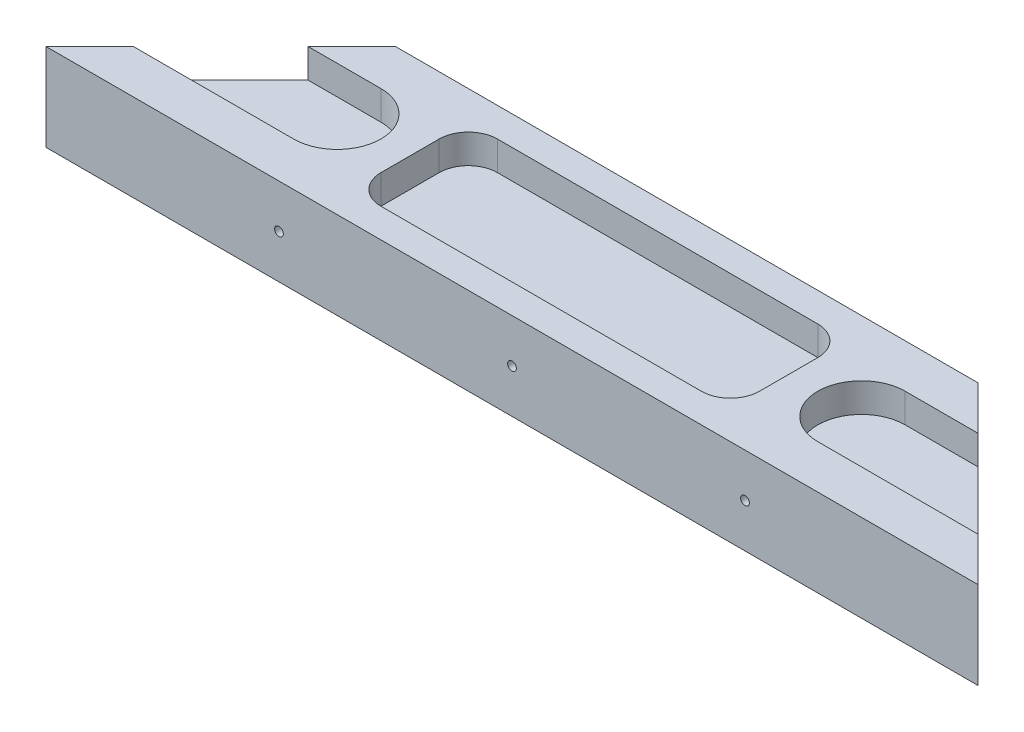
ISO-10303-21;
HEADER;
FILE_DESCRIPTION(('STEP AP214'),'2;1');
FILE_NAME('part.step','',(''),(''),'','','');
FILE_SCHEMA(('AUTOMOTIVE_DESIGN { 1 0 10303 214 1 1 1 1 }'));
ENDSEC;
DATA;
#1=APPLICATION_CONTEXT('core data for automotive mechanical design processes');
#2=APPLICATION_PROTOCOL_DEFINITION('international standard','automotive_design',2000,#1);
#3=PRODUCT_CONTEXT('',#1,'mechanical');
#4=PRODUCT('Part','Part','',(#3));
#5=PRODUCT_RELATED_PRODUCT_CATEGORY('part','',(#4));
#6=PRODUCT_DEFINITION_FORMATION('','',#4);
#7=PRODUCT_DEFINITION_CONTEXT('part definition',#1,'design');
#8=PRODUCT_DEFINITION('design','',#6,#7);
#9=PRODUCT_DEFINITION_SHAPE('','',#8);
#10=(LENGTH_UNIT() NAMED_UNIT(*) SI_UNIT(.MILLI.,.METRE.));
#11=(NAMED_UNIT(*) PLANE_ANGLE_UNIT() SI_UNIT($,.RADIAN.));
#12=(NAMED_UNIT(*) SI_UNIT($,.STERADIAN.) SOLID_ANGLE_UNIT());
#13=UNCERTAINTY_MEASURE_WITH_UNIT(LENGTH_MEASURE(1.E-05),#10,'distance_accuracy_value','');
#14=(GEOMETRIC_REPRESENTATION_CONTEXT(3) GLOBAL_UNCERTAINTY_ASSIGNED_CONTEXT((#13)) GLOBAL_UNIT_ASSIGNED_CONTEXT((#10,
#11,#12)) REPRESENTATION_CONTEXT('',''));
#15=CARTESIAN_POINT('',(0.,0.,0.));
#16=DIRECTION('',(0.,0.,1.));
#17=DIRECTION('',(1.,0.,0.));
#18=AXIS2_PLACEMENT_3D('',#15,#16,#17);
#19=CARTESIAN_POINT('',(30.,15.,-30.));
#20=DIRECTION('',(0.707106781186547,0.,0.707106781186548));
#21=DIRECTION('',(0.707106781186548,0.,-0.707106781186547));
#22=AXIS2_PLACEMENT_3D('',#19,#20,#21);
#23=PLANE('',#22);
#24=DIRECTION('',(-0.707106781186548,0.,0.707106781186547));
#25=VECTOR('',#24,1.);
#26=CARTESIAN_POINT('',(30.,10.,-30.));
#27=LINE('',#26,#25);
#28=CARTESIAN_POINT('',(22.5,10.,-22.5));
#29=VERTEX_POINT('',#28);
#30=CARTESIAN_POINT('',(7.5,10.,-7.5));
#31=VERTEX_POINT('',#30);
#32=EDGE_CURVE('E11',#29,#31,#27,.T.);
#33=ORIENTED_EDGE('',*,*,#32,.F.);
#34=DIRECTION('',(0.,1.,0.));
#35=VECTOR('',#34,1.);
#36=CARTESIAN_POINT('',(22.5,15.,-22.5));
#37=LINE('',#36,#35);
#38=CARTESIAN_POINT('',(22.5,15.,-22.5));
#39=VERTEX_POINT('',#38);
#40=EDGE_CURVE('E306',#29,#39,#37,.T.);
#41=ORIENTED_EDGE('',*,*,#40,.T.);
#42=DIRECTION('',(-0.707106781186548,0.,0.707106781186547));
#43=VECTOR('',#42,1.);
#44=CARTESIAN_POINT('',(30.,15.,-30.));
#45=LINE('',#44,#43);
#46=CARTESIAN_POINT('',(30.,15.,-30.));
#47=VERTEX_POINT('',#46);
#48=EDGE_CURVE('E310',#47,#39,#45,.T.);
#49=ORIENTED_EDGE('',*,*,#48,.F.);
#50=DIRECTION('',(0.,-1.,0.));
#51=VECTOR('',#50,1.);
#52=CARTESIAN_POINT('',(30.,15.,-30.));
#53=LINE('',#52,#51);
#54=CARTESIAN_POINT('',(30.,0.,-30.));
#55=VERTEX_POINT('',#54);
#56=EDGE_CURVE('E322',#47,#55,#53,.T.);
#57=ORIENTED_EDGE('',*,*,#56,.T.);
#58=DIRECTION('',(-0.707106781186548,0.,0.707106781186547));
#59=VECTOR('',#58,1.);
#60=CARTESIAN_POINT('',(30.,0.,-30.));
#61=LINE('',#60,#59);
#62=CARTESIAN_POINT('',(0.,0.,0.));
#63=VERTEX_POINT('',#62);
#64=EDGE_CURVE('E309',#55,#63,#61,.T.);
#65=ORIENTED_EDGE('',*,*,#64,.T.);
#66=DIRECTION('',(0.,-1.,0.));
#67=VECTOR('',#66,1.);
#68=CARTESIAN_POINT('',(0.,15.,0.));
#69=LINE('',#68,#67);
#70=CARTESIAN_POINT('',(0.,15.,0.));
#71=VERTEX_POINT('',#70);
#72=EDGE_CURVE('E339',#71,#63,#69,.T.);
#73=ORIENTED_EDGE('',*,*,#72,.F.);
#74=CARTESIAN_POINT('',(7.5,15.,-7.5));
#75=VERTEX_POINT('',#74);
#76=EDGE_CURVE('E314',#75,#71,#45,.T.);
#77=ORIENTED_EDGE('',*,*,#76,.F.);
#78=DIRECTION('',(0.,-1.,0.));
#79=VECTOR('',#78,1.);
#80=CARTESIAN_POINT('',(7.5,15.,-7.5));
#81=LINE('',#80,#79);
#82=EDGE_CURVE('E303',#75,#31,#81,.T.);
#83=ORIENTED_EDGE('',*,*,#82,.T.);
#84=EDGE_LOOP('',(#33,#41,#49,#57,#65,#73,#77,#83));
#85=FACE_BOUND('',#84,.T.);
#86=ADVANCED_FACE('F39',(#85),#23,.F.);
#87=CARTESIAN_POINT('',(0.,15.,0.));
#88=DIRECTION('',(0.,0.,-1.));
#89=DIRECTION('',(-1.,0.,0.));
#90=AXIS2_PLACEMENT_3D('',#87,#88,#89);
#91=PLANE('',#90);
#92=CARTESIAN_POINT('',(120.,7.5,0.));
#93=DIRECTION('',(0.,0.,1.));
#94=DIRECTION('',(1.,0.,0.));
#95=AXIS2_PLACEMENT_3D('',#92,#93,#94);
#96=CIRCLE('',#95,0.749999999999999);
#97=CARTESIAN_POINT('',(120.75,7.5,0.));
#98=VERTEX_POINT('',#97);
#99=EDGE_CURVE('E250',#98,#98,#96,.T.);
#100=ORIENTED_EDGE('',*,*,#99,.F.);
#101=EDGE_LOOP('',(#100));
#102=FACE_BOUND('',#101,.T.);
#103=CARTESIAN_POINT('',(40.,7.5,0.));
#104=DIRECTION('',(0.,0.,1.));
#105=DIRECTION('',(1.,0.,0.));
#106=AXIS2_PLACEMENT_3D('',#103,#104,#105);
#107=CIRCLE('',#106,0.749999999999999);
#108=CARTESIAN_POINT('',(40.75,7.5,0.));
#109=VERTEX_POINT('',#108);
#110=EDGE_CURVE('E249',#109,#109,#107,.T.);
#111=ORIENTED_EDGE('',*,*,#110,.F.);
#112=EDGE_LOOP('',(#111));
#113=FACE_BOUND('',#112,.T.);
#114=CARTESIAN_POINT('',(80.,7.5,0.));
#115=DIRECTION('',(0.,0.,1.));
#116=DIRECTION('',(1.,0.,0.));
#117=AXIS2_PLACEMENT_3D('',#114,#115,#116);
#118=CIRCLE('',#117,0.749999999999999);
#119=CARTESIAN_POINT('',(80.75,7.5,0.));
#120=VERTEX_POINT('',#119);
#121=EDGE_CURVE('E253',#120,#120,#118,.T.);
#122=ORIENTED_EDGE('',*,*,#121,.F.);
#123=EDGE_LOOP('',(#122));
#124=FACE_BOUND('',#123,.T.);
#125=DIRECTION('',(1.,0.,0.));
#126=VECTOR('',#125,1.);
#127=CARTESIAN_POINT('',(0.,0.,0.));
#128=LINE('',#127,#126);
#129=CARTESIAN_POINT('',(160.,0.,0.));
#130=VERTEX_POINT('',#129);
#131=EDGE_CURVE('E325',#63,#130,#128,.T.);
#132=ORIENTED_EDGE('',*,*,#131,.T.);
#133=DIRECTION('',(0.,-1.,0.));
#134=VECTOR('',#133,1.);
#135=CARTESIAN_POINT('',(160.,15.,0.));
#136=LINE('',#135,#134);
#137=CARTESIAN_POINT('',(160.,15.,0.));
#138=VERTEX_POINT('',#137);
#139=EDGE_CURVE('E336',#138,#130,#136,.T.);
#140=ORIENTED_EDGE('',*,*,#139,.F.);
#141=DIRECTION('',(1.,0.,0.));
#142=VECTOR('',#141,1.);
#143=CARTESIAN_POINT('',(0.,15.,0.));
#144=LINE('',#143,#142);
#145=EDGE_CURVE('E313',#71,#138,#144,.T.);
#146=ORIENTED_EDGE('',*,*,#145,.F.);
#147=ORIENTED_EDGE('',*,*,#72,.T.);
#148=EDGE_LOOP('',(#132,#140,#146,#147));
#149=FACE_BOUND('',#148,.T.);
#150=ADVANCED_FACE('F395',(#102,#113,#124,#149),#91,.F.);
#151=CARTESIAN_POINT('',(160.,15.,0.));
#152=DIRECTION('',(-0.707106781186547,0.,0.707106781186548));
#153=DIRECTION('',(0.707106781186548,0.,0.707106781186547));
#154=AXIS2_PLACEMENT_3D('',#151,#152,#153);
#155=PLANE('',#154);
#156=DIRECTION('',(0.707106781186548,0.,0.707106781186547));
#157=VECTOR('',#156,1.);
#158=CARTESIAN_POINT('',(160.,10.,0.));
#159=LINE('',#158,#157);
#160=CARTESIAN_POINT('',(137.5,10.,-22.5));
#161=VERTEX_POINT('',#160);
#162=CARTESIAN_POINT('',(152.5,10.,-7.50000000000001));
#163=VERTEX_POINT('',#162);
#164=EDGE_CURVE('E46',#161,#163,#159,.T.);
#165=ORIENTED_EDGE('',*,*,#164,.T.);
#166=DIRECTION('',(0.,1.,0.));
#167=VECTOR('',#166,1.);
#168=CARTESIAN_POINT('',(152.5,15.,-7.50000000000001));
#169=LINE('',#168,#167);
#170=CARTESIAN_POINT('',(152.5,15.,-7.50000000000001));
#171=VERTEX_POINT('',#170);
#172=EDGE_CURVE('E300',#163,#171,#169,.T.);
#173=ORIENTED_EDGE('',*,*,#172,.T.);
#174=DIRECTION('',(-0.707106781186548,0.,-0.707106781186547));
#175=VECTOR('',#174,1.);
#176=CARTESIAN_POINT('',(160.,15.,0.));
#177=LINE('',#176,#175);
#178=EDGE_CURVE('E317',#138,#171,#177,.T.);
#179=ORIENTED_EDGE('',*,*,#178,.F.);
#180=ORIENTED_EDGE('',*,*,#139,.T.);
#181=DIRECTION('',(-0.707106781186548,0.,-0.707106781186547));
#182=VECTOR('',#181,1.);
#183=CARTESIAN_POINT('',(160.,0.,0.));
#184=LINE('',#183,#182);
#185=CARTESIAN_POINT('',(130.,0.,-30.));
#186=VERTEX_POINT('',#185);
#187=EDGE_CURVE('E327',#130,#186,#184,.T.);
#188=ORIENTED_EDGE('',*,*,#187,.T.);
#189=DIRECTION('',(0.,-1.,0.));
#190=VECTOR('',#189,1.);
#191=CARTESIAN_POINT('',(130.,15.,-30.));
#192=LINE('',#191,#190);
#193=CARTESIAN_POINT('',(130.,15.,-30.));
#194=VERTEX_POINT('',#193);
#195=EDGE_CURVE('E333',#194,#186,#192,.T.);
#196=ORIENTED_EDGE('',*,*,#195,.F.);
#197=CARTESIAN_POINT('',(137.5,15.,-22.5));
#198=VERTEX_POINT('',#197);
#199=EDGE_CURVE('E316',#198,#194,#177,.T.);
#200=ORIENTED_EDGE('',*,*,#199,.F.);
#201=DIRECTION('',(0.,-1.,0.));
#202=VECTOR('',#201,1.);
#203=CARTESIAN_POINT('',(137.5,15.,-22.5));
#204=LINE('',#203,#202);
#205=EDGE_CURVE('E61',#198,#161,#204,.T.);
#206=ORIENTED_EDGE('',*,*,#205,.T.);
#207=EDGE_LOOP('',(#165,#173,#179,#180,#188,#196,#200,#206));
#208=FACE_BOUND('',#207,.T.);
#209=ADVANCED_FACE('F348',(#208),#155,.F.);
#210=CARTESIAN_POINT('',(130.,15.,-30.));
#211=DIRECTION('',(0.,0.,1.));
#212=DIRECTION('',(1.,0.,0.));
#213=AXIS2_PLACEMENT_3D('',#210,#211,#212);
#214=PLANE('',#213);
#215=CARTESIAN_POINT('',(120.,7.5,-30.));
#216=DIRECTION('',(0.,0.,1.));
#217=DIRECTION('',(1.,0.,0.));
#218=AXIS2_PLACEMENT_3D('',#215,#216,#217);
#219=CIRCLE('',#218,0.749999999999999);
#220=CARTESIAN_POINT('',(120.75,7.5,-30.));
#221=VERTEX_POINT('',#220);
#222=EDGE_CURVE('E234',#221,#221,#219,.F.);
#223=ORIENTED_EDGE('',*,*,#222,.F.);
#224=EDGE_LOOP('',(#223));
#225=FACE_BOUND('',#224,.T.);
#226=CARTESIAN_POINT('',(40.,7.5,-30.));
#227=DIRECTION('',(0.,0.,1.));
#228=DIRECTION('',(1.,0.,0.));
#229=AXIS2_PLACEMENT_3D('',#226,#227,#228);
#230=CIRCLE('',#229,0.749999999999999);
#231=CARTESIAN_POINT('',(40.75,7.5,-30.));
#232=VERTEX_POINT('',#231);
#233=EDGE_CURVE('E246',#232,#232,#230,.F.);
#234=ORIENTED_EDGE('',*,*,#233,.F.);
#235=EDGE_LOOP('',(#234));
#236=FACE_BOUND('',#235,.T.);
#237=CARTESIAN_POINT('',(80.,7.5,-30.));
#238=DIRECTION('',(0.,0.,1.));
#239=DIRECTION('',(1.,0.,0.));
#240=AXIS2_PLACEMENT_3D('',#237,#238,#239);
#241=CIRCLE('',#240,0.749999999999999);
#242=CARTESIAN_POINT('',(80.75,7.5,-30.));
#243=VERTEX_POINT('',#242);
#244=EDGE_CURVE('E260',#243,#243,#241,.F.);
#245=ORIENTED_EDGE('',*,*,#244,.F.);
#246=EDGE_LOOP('',(#245));
#247=FACE_BOUND('',#246,.T.);
#248=DIRECTION('',(-1.,0.,0.));
#249=VECTOR('',#248,1.);
#250=CARTESIAN_POINT('',(130.,0.,-30.));
#251=LINE('',#250,#249);
#252=EDGE_CURVE('E329',#186,#55,#251,.T.);
#253=ORIENTED_EDGE('',*,*,#252,.T.);
#254=ORIENTED_EDGE('',*,*,#56,.F.);
#255=DIRECTION('',(-1.,0.,0.));
#256=VECTOR('',#255,1.);
#257=CARTESIAN_POINT('',(130.,15.,-30.));
#258=LINE('',#257,#256);
#259=EDGE_CURVE('E320',#194,#47,#258,.T.);
#260=ORIENTED_EDGE('',*,*,#259,.F.);
#261=ORIENTED_EDGE('',*,*,#195,.T.);
#262=EDGE_LOOP('',(#253,#254,#260,#261));
#263=FACE_BOUND('',#262,.T.);
#264=ADVANCED_FACE('F376',(#225,#236,#247,#263),#214,.F.);
#265=CARTESIAN_POINT('',(0.,15.,0.));
#266=DIRECTION('',(0.,-1.,0.));
#267=DIRECTION('',(0.,0.,-1.));
#268=AXIS2_PLACEMENT_3D('',#265,#266,#267);
#269=PLANE('',#268);
#270=DIRECTION('',(-1.,0.,0.));
#271=VECTOR('',#270,1.);
#272=CARTESIAN_POINT('',(52.5,15.,-25.));
#273=LINE('',#272,#271);
#274=CARTESIAN_POINT('',(107.5,15.,-25.));
#275=VERTEX_POINT('',#274);
#276=CARTESIAN_POINT('',(52.5,15.,-25.));
#277=VERTEX_POINT('',#276);
#278=EDGE_CURVE('E216',#275,#277,#273,.T.);
#279=ORIENTED_EDGE('',*,*,#278,.F.);
#280=CARTESIAN_POINT('',(107.5,15.,-20.));
#281=DIRECTION('',(0.,1.,0.));
#282=DIRECTION('',(0.,0.,-1.));
#283=AXIS2_PLACEMENT_3D('',#280,#281,#282);
#284=CIRCLE('',#283,5.);
#285=CARTESIAN_POINT('',(112.5,15.,-20.));
#286=VERTEX_POINT('',#285);
#287=EDGE_CURVE('E53',#286,#275,#284,.T.);
#288=ORIENTED_EDGE('',*,*,#287,.F.);
#289=DIRECTION('',(0.,0.,-1.));
#290=VECTOR('',#289,1.);
#291=CARTESIAN_POINT('',(112.5,15.,-20.));
#292=LINE('',#291,#290);
#293=CARTESIAN_POINT('',(112.5,15.,-10.));
#294=VERTEX_POINT('',#293);
#295=EDGE_CURVE('E196',#294,#286,#292,.T.);
#296=ORIENTED_EDGE('',*,*,#295,.F.);
#297=CARTESIAN_POINT('',(107.5,15.,-10.));
#298=DIRECTION('',(0.,1.,0.));
#299=DIRECTION('',(0.,0.,1.));
#300=AXIS2_PLACEMENT_3D('',#297,#298,#299);
#301=CIRCLE('',#300,5.);
#302=CARTESIAN_POINT('',(107.5,15.,-5.));
#303=VERTEX_POINT('',#302);
#304=EDGE_CURVE('E199',#303,#294,#301,.T.);
#305=ORIENTED_EDGE('',*,*,#304,.F.);
#306=DIRECTION('',(1.,0.,0.));
#307=VECTOR('',#306,1.);
#308=CARTESIAN_POINT('',(52.5,15.,-5.));
#309=LINE('',#308,#307);
#310=CARTESIAN_POINT('',(52.5,15.,-5.));
#311=VERTEX_POINT('',#310);
#312=EDGE_CURVE('E227',#311,#303,#309,.T.);
#313=ORIENTED_EDGE('',*,*,#312,.F.);
#314=CARTESIAN_POINT('',(52.5,15.,-10.));
#315=DIRECTION('',(0.,1.,0.));
#316=DIRECTION('',(0.,0.,1.));
#317=AXIS2_PLACEMENT_3D('',#314,#315,#316);
#318=CIRCLE('',#317,5.);
#319=CARTESIAN_POINT('',(47.5,15.,-10.));
#320=VERTEX_POINT('',#319);
#321=EDGE_CURVE('E224',#320,#311,#318,.T.);
#322=ORIENTED_EDGE('',*,*,#321,.F.);
#323=DIRECTION('',(0.,0.,1.));
#324=VECTOR('',#323,1.);
#325=CARTESIAN_POINT('',(47.5,15.,-20.));
#326=LINE('',#325,#324);
#327=CARTESIAN_POINT('',(47.5,15.,-20.));
#328=VERTEX_POINT('',#327);
#329=EDGE_CURVE('E221',#328,#320,#326,.T.);
#330=ORIENTED_EDGE('',*,*,#329,.F.);
#331=CARTESIAN_POINT('',(52.5,15.,-20.));
#332=DIRECTION('',(0.,1.,0.));
#333=DIRECTION('',(0.,0.,1.));
#334=AXIS2_PLACEMENT_3D('',#331,#332,#333);
#335=CIRCLE('',#334,5.);
#336=EDGE_CURVE('E218',#277,#328,#335,.T.);
#337=ORIENTED_EDGE('',*,*,#336,.F.);
#338=EDGE_LOOP('',(#279,#288,#296,#305,#313,#322,#330,#337));
#339=FACE_BOUND('',#338,.T.);
#340=ORIENTED_EDGE('',*,*,#48,.T.);
#341=DIRECTION('',(-1.,0.,0.));
#342=VECTOR('',#341,1.);
#343=CARTESIAN_POINT('',(-5.,15.,-22.5));
#344=LINE('',#343,#342);
#345=CARTESIAN_POINT('',(35.,15.,-22.5));
#346=VERTEX_POINT('',#345);
#347=EDGE_CURVE('E267',#346,#39,#344,.T.);
#348=ORIENTED_EDGE('',*,*,#347,.F.);
#349=CARTESIAN_POINT('',(35.,15.,-15.));
#350=DIRECTION('',(0.,1.,0.));
#351=DIRECTION('',(0.,0.,1.));
#352=AXIS2_PLACEMENT_3D('',#349,#350,#351);
#353=CIRCLE('',#352,7.5);
#354=CARTESIAN_POINT('',(35.,15.,-7.5));
#355=VERTEX_POINT('',#354);
#356=EDGE_CURVE('E274',#355,#346,#353,.T.);
#357=ORIENTED_EDGE('',*,*,#356,.F.);
#358=DIRECTION('',(-1.,0.,0.));
#359=VECTOR('',#358,1.);
#360=CARTESIAN_POINT('',(0.,15.,-7.5));
#361=LINE('',#360,#359);
#362=EDGE_CURVE('E344',#355,#75,#361,.T.);
#363=ORIENTED_EDGE('',*,*,#362,.T.);
#364=ORIENTED_EDGE('',*,*,#76,.T.);
#365=ORIENTED_EDGE('',*,*,#145,.T.);
#366=ORIENTED_EDGE('',*,*,#178,.T.);
#367=DIRECTION('',(1.,0.,0.));
#368=VECTOR('',#367,1.);
#369=CARTESIAN_POINT('',(165.,15.,-7.50000000000001));
#370=LINE('',#369,#368);
#371=CARTESIAN_POINT('',(125.,15.,-7.50000000000002));
#372=VERTEX_POINT('',#371);
#373=EDGE_CURVE('E288',#372,#171,#370,.T.);
#374=ORIENTED_EDGE('',*,*,#373,.F.);
#375=CARTESIAN_POINT('',(125.,15.,-15.));
#376=DIRECTION('',(0.,1.,0.));
#377=DIRECTION('',(0.,0.,-1.));
#378=AXIS2_PLACEMENT_3D('',#375,#376,#377);
#379=CIRCLE('',#378,7.49999999999999);
#380=CARTESIAN_POINT('',(125.,15.,-22.5));
#381=VERTEX_POINT('',#380);
#382=EDGE_CURVE('E277',#381,#372,#379,.T.);
#383=ORIENTED_EDGE('',*,*,#382,.F.);
#384=DIRECTION('',(1.,0.,0.));
#385=VECTOR('',#384,1.);
#386=CARTESIAN_POINT('',(0.,15.,-22.5));
#387=LINE('',#386,#385);
#388=EDGE_CURVE('E342',#381,#198,#387,.T.);
#389=ORIENTED_EDGE('',*,*,#388,.T.);
#390=ORIENTED_EDGE('',*,*,#199,.T.);
#391=ORIENTED_EDGE('',*,*,#259,.T.);
#392=EDGE_LOOP('',(#340,#348,#357,#363,#364,#365,#366,#374,#383,#389,#390,#391));
#393=FACE_BOUND('',#392,.T.);
#394=ADVANCED_FACE('F364',(#339,#393),#269,.F.);
#395=CARTESIAN_POINT('',(0.,0.,0.));
#396=DIRECTION('',(0.,-1.,0.));
#397=DIRECTION('',(0.,0.,-1.));
#398=AXIS2_PLACEMENT_3D('',#395,#396,#397);
#399=PLANE('',#398);
#400=ORIENTED_EDGE('',*,*,#64,.F.);
#401=ORIENTED_EDGE('',*,*,#252,.F.);
#402=ORIENTED_EDGE('',*,*,#187,.F.);
#403=ORIENTED_EDGE('',*,*,#131,.F.);
#404=EDGE_LOOP('',(#400,#401,#402,#403));
#405=FACE_BOUND('',#404,.T.);
#406=ADVANCED_FACE('F373',(#405),#399,.T.);
#407=CARTESIAN_POINT('',(165.,10.,-15.));
#408=DIRECTION('',(0.,-1.,0.));
#409=DIRECTION('',(0.,0.,-1.));
#410=AXIS2_PLACEMENT_3D('',#407,#408,#409);
#411=PLANE('',#410);
#412=DIRECTION('',(-1.,0.,0.));
#413=VECTOR('',#412,1.);
#414=CARTESIAN_POINT('',(165.,10.,-22.5));
#415=LINE('',#414,#413);
#416=CARTESIAN_POINT('',(125.,10.,-22.5));
#417=VERTEX_POINT('',#416);
#418=EDGE_CURVE('E290',#161,#417,#415,.T.);
#419=ORIENTED_EDGE('',*,*,#418,.T.);
#420=CARTESIAN_POINT('',(125.,10.,-15.));
#421=DIRECTION('',(0.,1.,0.));
#422=DIRECTION('',(0.,0.,-1.));
#423=AXIS2_PLACEMENT_3D('',#420,#421,#422);
#424=CIRCLE('',#423,7.49999999999999);
#425=CARTESIAN_POINT('',(125.,10.,-7.50000000000002));
#426=VERTEX_POINT('',#425);
#427=EDGE_CURVE('E295',#417,#426,#424,.T.);
#428=ORIENTED_EDGE('',*,*,#427,.T.);
#429=DIRECTION('',(1.,0.,0.));
#430=VECTOR('',#429,1.);
#431=CARTESIAN_POINT('',(165.,10.,-7.50000000000001));
#432=LINE('',#431,#430);
#433=EDGE_CURVE('E286',#426,#163,#432,.T.);
#434=ORIENTED_EDGE('',*,*,#433,.T.);
#435=ORIENTED_EDGE('',*,*,#164,.F.);
#436=EDGE_LOOP('',(#419,#428,#434,#435));
#437=FACE_BOUND('',#436,.T.);
#438=ADVANCED_FACE('F352',(#437),#411,.F.);
#439=CARTESIAN_POINT('',(165.,10.,-7.50000000000001));
#440=DIRECTION('',(0.,0.,1.));
#441=DIRECTION('',(1.,0.,0.));
#442=AXIS2_PLACEMENT_3D('',#439,#440,#441);
#443=PLANE('',#442);
#444=ORIENTED_EDGE('',*,*,#433,.F.);
#445=DIRECTION('',(0.,1.,0.));
#446=VECTOR('',#445,1.);
#447=CARTESIAN_POINT('',(125.,10.,-7.50000000000002));
#448=LINE('',#447,#446);
#449=EDGE_CURVE('E263',#426,#372,#448,.T.);
#450=ORIENTED_EDGE('',*,*,#449,.T.);
#451=ORIENTED_EDGE('',*,*,#373,.T.);
#452=ORIENTED_EDGE('',*,*,#172,.F.);
#453=EDGE_LOOP('',(#444,#450,#451,#452));
#454=FACE_BOUND('',#453,.T.);
#455=ADVANCED_FACE('F361',(#454),#443,.F.);
#456=CARTESIAN_POINT('',(165.,10.,-22.5));
#457=DIRECTION('',(0.,0.,-1.));
#458=DIRECTION('',(-1.,0.,0.));
#459=AXIS2_PLACEMENT_3D('',#456,#457,#458);
#460=PLANE('',#459);
#461=ORIENTED_EDGE('',*,*,#388,.F.);
#462=DIRECTION('',(0.,1.,0.));
#463=VECTOR('',#462,1.);
#464=CARTESIAN_POINT('',(125.,10.,-22.5));
#465=LINE('',#464,#463);
#466=EDGE_CURVE('E283',#417,#381,#465,.T.);
#467=ORIENTED_EDGE('',*,*,#466,.F.);
#468=ORIENTED_EDGE('',*,*,#418,.F.);
#469=ORIENTED_EDGE('',*,*,#205,.F.);
#470=EDGE_LOOP('',(#461,#467,#468,#469));
#471=FACE_BOUND('',#470,.T.);
#472=ADVANCED_FACE('F355',(#471),#460,.F.);
#473=CARTESIAN_POINT('',(125.,10.,-15.));
#474=DIRECTION('',(0.,1.,0.));
#475=DIRECTION('',(0.,0.,1.));
#476=AXIS2_PLACEMENT_3D('',#473,#474,#475);
#477=CYLINDRICAL_SURFACE('',#476,7.49999999999999);
#478=ORIENTED_EDGE('',*,*,#382,.T.);
#479=ORIENTED_EDGE('',*,*,#449,.F.);
#480=ORIENTED_EDGE('',*,*,#427,.F.);
#481=ORIENTED_EDGE('',*,*,#466,.T.);
#482=EDGE_LOOP('',(#478,#479,#480,#481));
#483=FACE_BOUND('',#482,.T.);
#484=ADVANCED_FACE('F359',(#483),#477,.F.);
#485=CARTESIAN_POINT('',(-5.,10.,-15.));
#486=DIRECTION('',(0.,1.,0.));
#487=DIRECTION('',(0.,0.,1.));
#488=AXIS2_PLACEMENT_3D('',#485,#486,#487);
#489=PLANE('',#488);
#490=ORIENTED_EDGE('',*,*,#32,.T.);
#491=DIRECTION('',(1.,0.,0.));
#492=VECTOR('',#491,1.);
#493=CARTESIAN_POINT('',(-5.,10.,-7.5));
#494=LINE('',#493,#492);
#495=CARTESIAN_POINT('',(35.,10.,-7.5));
#496=VERTEX_POINT('',#495);
#497=EDGE_CURVE('E264',#31,#496,#494,.T.);
#498=ORIENTED_EDGE('',*,*,#497,.T.);
#499=CARTESIAN_POINT('',(35.,10.,-15.));
#500=DIRECTION('',(0.,1.,0.));
#501=DIRECTION('',(0.,0.,1.));
#502=AXIS2_PLACEMENT_3D('',#499,#500,#501);
#503=CIRCLE('',#502,7.5);
#504=CARTESIAN_POINT('',(35.,10.,-22.5));
#505=VERTEX_POINT('',#504);
#506=EDGE_CURVE('E266',#496,#505,#503,.T.);
#507=ORIENTED_EDGE('',*,*,#506,.T.);
#508=DIRECTION('',(-1.,0.,0.));
#509=VECTOR('',#508,1.);
#510=CARTESIAN_POINT('',(-5.,10.,-22.5));
#511=LINE('',#510,#509);
#512=EDGE_CURVE('E270',#505,#29,#511,.T.);
#513=ORIENTED_EDGE('',*,*,#512,.T.);
#514=EDGE_LOOP('',(#490,#498,#507,#513));
#515=FACE_BOUND('',#514,.T.);
#516=ADVANCED_FACE('F421',(#515),#489,.T.);
#517=CARTESIAN_POINT('',(-5.,10.,-22.5));
#518=DIRECTION('',(0.,0.,-1.));
#519=DIRECTION('',(-1.,0.,0.));
#520=AXIS2_PLACEMENT_3D('',#517,#518,#519);
#521=PLANE('',#520);
#522=ORIENTED_EDGE('',*,*,#512,.F.);
#523=DIRECTION('',(0.,1.,0.));
#524=VECTOR('',#523,1.);
#525=CARTESIAN_POINT('',(35.,10.,-22.5));
#526=LINE('',#525,#524);
#527=EDGE_CURVE('E279',#505,#346,#526,.T.);
#528=ORIENTED_EDGE('',*,*,#527,.T.);
#529=ORIENTED_EDGE('',*,*,#347,.T.);
#530=ORIENTED_EDGE('',*,*,#40,.F.);
#531=EDGE_LOOP('',(#522,#528,#529,#530));
#532=FACE_BOUND('',#531,.T.);
#533=ADVANCED_FACE('F386',(#532),#521,.F.);
#534=CARTESIAN_POINT('',(-5.,10.,-7.5));
#535=DIRECTION('',(0.,0.,1.));
#536=DIRECTION('',(1.,0.,0.));
#537=AXIS2_PLACEMENT_3D('',#534,#535,#536);
#538=PLANE('',#537);
#539=ORIENTED_EDGE('',*,*,#362,.F.);
#540=DIRECTION('',(0.,1.,0.));
#541=VECTOR('',#540,1.);
#542=CARTESIAN_POINT('',(35.,10.,-7.5));
#543=LINE('',#542,#541);
#544=EDGE_CURVE('E273',#496,#355,#543,.T.);
#545=ORIENTED_EDGE('',*,*,#544,.F.);
#546=ORIENTED_EDGE('',*,*,#497,.F.);
#547=ORIENTED_EDGE('',*,*,#82,.F.);
#548=EDGE_LOOP('',(#539,#545,#546,#547));
#549=FACE_BOUND('',#548,.T.);
#550=ADVANCED_FACE('F393',(#549),#538,.F.);
#551=CARTESIAN_POINT('',(35.,10.,-15.));
#552=DIRECTION('',(0.,1.,0.));
#553=DIRECTION('',(0.,0.,1.));
#554=AXIS2_PLACEMENT_3D('',#551,#552,#553);
#555=CYLINDRICAL_SURFACE('',#554,7.5);
#556=ORIENTED_EDGE('',*,*,#356,.T.);
#557=ORIENTED_EDGE('',*,*,#527,.F.);
#558=ORIENTED_EDGE('',*,*,#506,.F.);
#559=ORIENTED_EDGE('',*,*,#544,.T.);
#560=EDGE_LOOP('',(#556,#557,#558,#559));
#561=FACE_BOUND('',#560,.T.);
#562=ADVANCED_FACE('F389',(#561),#555,.F.);
#563=CARTESIAN_POINT('',(80.,7.5,-32.1213203435596));
#564=DIRECTION('',(0.,0.,1.));
#565=DIRECTION('',(1.,0.,0.));
#566=AXIS2_PLACEMENT_3D('',#563,#564,#565);
#567=CYLINDRICAL_SURFACE('',#566,0.749999999999999);
#568=ORIENTED_EDGE('',*,*,#244,.T.);
#569=EDGE_LOOP('',(#568));
#570=FACE_BOUND('',#569,.T.);
#571=ORIENTED_EDGE('',*,*,#121,.T.);
#572=EDGE_LOOP('',(#571));
#573=FACE_BOUND('',#572,.T.);
#574=ADVANCED_FACE('F427',(#570,#573),#567,.F.);
#575=CARTESIAN_POINT('',(40.,7.5,-32.1213203435596));
#576=DIRECTION('',(0.,0.,1.));
#577=DIRECTION('',(1.,0.,0.));
#578=AXIS2_PLACEMENT_3D('',#575,#576,#577);
#579=CYLINDRICAL_SURFACE('',#578,0.749999999999999);
#580=ORIENTED_EDGE('',*,*,#233,.T.);
#581=EDGE_LOOP('',(#580));
#582=FACE_BOUND('',#581,.T.);
#583=ORIENTED_EDGE('',*,*,#110,.T.);
#584=EDGE_LOOP('',(#583));
#585=FACE_BOUND('',#584,.T.);
#586=ADVANCED_FACE('F435',(#582,#585),#579,.F.);
#587=CARTESIAN_POINT('',(120.,7.5,-32.1213203435596));
#588=DIRECTION('',(0.,0.,1.));
#589=DIRECTION('',(1.,0.,0.));
#590=AXIS2_PLACEMENT_3D('',#587,#588,#589);
#591=CYLINDRICAL_SURFACE('',#590,0.749999999999999);
#592=ORIENTED_EDGE('',*,*,#222,.T.);
#593=EDGE_LOOP('',(#592));
#594=FACE_BOUND('',#593,.T.);
#595=ORIENTED_EDGE('',*,*,#99,.T.);
#596=EDGE_LOOP('',(#595));
#597=FACE_BOUND('',#596,.T.);
#598=ADVANCED_FACE('F437',(#594,#597),#591,.F.);
#599=CARTESIAN_POINT('',(107.5,10.,-20.));
#600=DIRECTION('',(0.,1.,0.));
#601=DIRECTION('',(0.,0.,1.));
#602=AXIS2_PLACEMENT_3D('',#599,#600,#601);
#603=CYLINDRICAL_SURFACE('',#602,5.);
#604=ORIENTED_EDGE('',*,*,#287,.T.);
#605=DIRECTION('',(0.,1.,0.));
#606=VECTOR('',#605,1.);
#607=CARTESIAN_POINT('',(107.5,10.,-25.));
#608=LINE('',#607,#606);
#609=CARTESIAN_POINT('',(107.5,10.,-25.));
#610=VERTEX_POINT('',#609);
#611=EDGE_CURVE('E173',#610,#275,#608,.T.);
#612=ORIENTED_EDGE('',*,*,#611,.F.);
#613=CARTESIAN_POINT('',(107.5,10.,-20.));
#614=DIRECTION('',(0.,1.,0.));
#615=DIRECTION('',(0.,0.,-1.));
#616=AXIS2_PLACEMENT_3D('',#613,#614,#615);
#617=CIRCLE('',#616,5.);
#618=CARTESIAN_POINT('',(112.5,10.,-20.));
#619=VERTEX_POINT('',#618);
#620=EDGE_CURVE('E177',#619,#610,#617,.T.);
#621=ORIENTED_EDGE('',*,*,#620,.F.);
#622=DIRECTION('',(0.,1.,0.));
#623=VECTOR('',#622,1.);
#624=CARTESIAN_POINT('',(112.5,10.,-20.));
#625=LINE('',#624,#623);
#626=EDGE_CURVE('E232',#619,#286,#625,.T.);
#627=ORIENTED_EDGE('',*,*,#626,.T.);
#628=EDGE_LOOP('',(#604,#612,#621,#627));
#629=FACE_BOUND('',#628,.T.);
#630=ADVANCED_FACE('F175',(#629),#603,.F.);
#631=CARTESIAN_POINT('',(112.5,10.,-20.));
#632=DIRECTION('',(1.,0.,0.));
#633=DIRECTION('',(0.,0.,-1.));
#634=AXIS2_PLACEMENT_3D('',#631,#632,#633);
#635=PLANE('',#634);
#636=ORIENTED_EDGE('',*,*,#295,.T.);
#637=ORIENTED_EDGE('',*,*,#626,.F.);
#638=DIRECTION('',(0.,0.,-1.));
#639=VECTOR('',#638,1.);
#640=CARTESIAN_POINT('',(112.5,10.,-20.));
#641=LINE('',#640,#639);
#642=CARTESIAN_POINT('',(112.5,10.,-10.));
#643=VERTEX_POINT('',#642);
#644=EDGE_CURVE('E183',#643,#619,#641,.T.);
#645=ORIENTED_EDGE('',*,*,#644,.F.);
#646=DIRECTION('',(0.,1.,0.));
#647=VECTOR('',#646,1.);
#648=CARTESIAN_POINT('',(112.5,10.,-10.));
#649=LINE('',#648,#647);
#650=EDGE_CURVE('E235',#643,#294,#649,.T.);
#651=ORIENTED_EDGE('',*,*,#650,.T.);
#652=EDGE_LOOP('',(#636,#637,#645,#651));
#653=FACE_BOUND('',#652,.T.);
#654=ADVANCED_FACE('F446',(#653),#635,.F.);
#655=CARTESIAN_POINT('',(107.5,10.,-10.));
#656=DIRECTION('',(0.,1.,0.));
#657=DIRECTION('',(0.,0.,1.));
#658=AXIS2_PLACEMENT_3D('',#655,#656,#657);
#659=CYLINDRICAL_SURFACE('',#658,5.);
#660=ORIENTED_EDGE('',*,*,#304,.T.);
#661=ORIENTED_EDGE('',*,*,#650,.F.);
#662=CARTESIAN_POINT('',(107.5,10.,-10.));
#663=DIRECTION('',(0.,1.,0.));
#664=DIRECTION('',(0.,0.,1.));
#665=AXIS2_PLACEMENT_3D('',#662,#663,#664);
#666=CIRCLE('',#665,5.);
#667=CARTESIAN_POINT('',(107.5,10.,-5.));
#668=VERTEX_POINT('',#667);
#669=EDGE_CURVE('E212',#668,#643,#666,.T.);
#670=ORIENTED_EDGE('',*,*,#669,.F.);
#671=DIRECTION('',(0.,1.,0.));
#672=VECTOR('',#671,1.);
#673=CARTESIAN_POINT('',(107.5,10.,-5.));
#674=LINE('',#673,#672);
#675=EDGE_CURVE('E237',#668,#303,#674,.T.);
#676=ORIENTED_EDGE('',*,*,#675,.T.);
#677=EDGE_LOOP('',(#660,#661,#670,#676));
#678=FACE_BOUND('',#677,.T.);
#679=ADVANCED_FACE('F464',(#678),#659,.F.);
#680=CARTESIAN_POINT('',(52.5,10.,-5.));
#681=DIRECTION('',(0.,0.,1.));
#682=DIRECTION('',(1.,0.,0.));
#683=AXIS2_PLACEMENT_3D('',#680,#681,#682);
#684=PLANE('',#683);
#685=ORIENTED_EDGE('',*,*,#312,.T.);
#686=ORIENTED_EDGE('',*,*,#675,.F.);
#687=DIRECTION('',(1.,0.,0.));
#688=VECTOR('',#687,1.);
#689=CARTESIAN_POINT('',(52.5,10.,-5.));
#690=LINE('',#689,#688);
#691=CARTESIAN_POINT('',(52.5,10.,-5.));
#692=VERTEX_POINT('',#691);
#693=EDGE_CURVE('E209',#692,#668,#690,.T.);
#694=ORIENTED_EDGE('',*,*,#693,.F.);
#695=DIRECTION('',(0.,1.,0.));
#696=VECTOR('',#695,1.);
#697=CARTESIAN_POINT('',(52.5,10.,-5.));
#698=LINE('',#697,#696);
#699=EDGE_CURVE('E239',#692,#311,#698,.T.);
#700=ORIENTED_EDGE('',*,*,#699,.T.);
#701=EDGE_LOOP('',(#685,#686,#694,#700));
#702=FACE_BOUND('',#701,.T.);
#703=ADVANCED_FACE('F460',(#702),#684,.F.);
#704=CARTESIAN_POINT('',(52.5,10.,-10.));
#705=DIRECTION('',(0.,1.,0.));
#706=DIRECTION('',(0.,0.,1.));
#707=AXIS2_PLACEMENT_3D('',#704,#705,#706);
#708=CYLINDRICAL_SURFACE('',#707,5.);
#709=ORIENTED_EDGE('',*,*,#321,.T.);
#710=ORIENTED_EDGE('',*,*,#699,.F.);
#711=CARTESIAN_POINT('',(52.5,10.,-10.));
#712=DIRECTION('',(0.,1.,0.));
#713=DIRECTION('',(0.,0.,1.));
#714=AXIS2_PLACEMENT_3D('',#711,#712,#713);
#715=CIRCLE('',#714,5.);
#716=CARTESIAN_POINT('',(47.5,10.,-10.));
#717=VERTEX_POINT('',#716);
#718=EDGE_CURVE('E206',#717,#692,#715,.T.);
#719=ORIENTED_EDGE('',*,*,#718,.F.);
#720=DIRECTION('',(0.,1.,0.));
#721=VECTOR('',#720,1.);
#722=CARTESIAN_POINT('',(47.5,10.,-10.));
#723=LINE('',#722,#721);
#724=EDGE_CURVE('E241',#717,#320,#723,.T.);
#725=ORIENTED_EDGE('',*,*,#724,.T.);
#726=EDGE_LOOP('',(#709,#710,#719,#725));
#727=FACE_BOUND('',#726,.T.);
#728=ADVANCED_FACE('F456',(#727),#708,.F.);
#729=CARTESIAN_POINT('',(47.5,10.,-20.));
#730=DIRECTION('',(-1.,0.,0.));
#731=DIRECTION('',(0.,0.,1.));
#732=AXIS2_PLACEMENT_3D('',#729,#730,#731);
#733=PLANE('',#732);
#734=ORIENTED_EDGE('',*,*,#329,.T.);
#735=ORIENTED_EDGE('',*,*,#724,.F.);
#736=DIRECTION('',(0.,0.,1.));
#737=VECTOR('',#736,1.);
#738=CARTESIAN_POINT('',(47.5,10.,-20.));
#739=LINE('',#738,#737);
#740=CARTESIAN_POINT('',(47.5,10.,-20.));
#741=VERTEX_POINT('',#740);
#742=EDGE_CURVE('E203',#741,#717,#739,.T.);
#743=ORIENTED_EDGE('',*,*,#742,.F.);
#744=DIRECTION('',(0.,1.,0.));
#745=VECTOR('',#744,1.);
#746=CARTESIAN_POINT('',(47.5,10.,-20.));
#747=LINE('',#746,#745);
#748=EDGE_CURVE('E243',#741,#328,#747,.T.);
#749=ORIENTED_EDGE('',*,*,#748,.T.);
#750=EDGE_LOOP('',(#734,#735,#743,#749));
#751=FACE_BOUND('',#750,.T.);
#752=ADVANCED_FACE('F452',(#751),#733,.F.);
#753=CARTESIAN_POINT('',(52.5,10.,-20.));
#754=DIRECTION('',(0.,1.,0.));
#755=DIRECTION('',(0.,0.,1.));
#756=AXIS2_PLACEMENT_3D('',#753,#754,#755);
#757=CYLINDRICAL_SURFACE('',#756,5.);
#758=ORIENTED_EDGE('',*,*,#336,.T.);
#759=ORIENTED_EDGE('',*,*,#748,.F.);
#760=CARTESIAN_POINT('',(52.5,10.,-20.));
#761=DIRECTION('',(0.,1.,0.));
#762=DIRECTION('',(0.,0.,1.));
#763=AXIS2_PLACEMENT_3D('',#760,#761,#762);
#764=CIRCLE('',#763,5.);
#765=CARTESIAN_POINT('',(52.5,10.,-25.));
#766=VERTEX_POINT('',#765);
#767=EDGE_CURVE('E191',#766,#741,#764,.T.);
#768=ORIENTED_EDGE('',*,*,#767,.F.);
#769=DIRECTION('',(0.,1.,0.));
#770=VECTOR('',#769,1.);
#771=CARTESIAN_POINT('',(52.5,10.,-25.));
#772=LINE('',#771,#770);
#773=EDGE_CURVE('E182',#766,#277,#772,.T.);
#774=ORIENTED_EDGE('',*,*,#773,.T.);
#775=EDGE_LOOP('',(#758,#759,#768,#774));
#776=FACE_BOUND('',#775,.T.);
#777=ADVANCED_FACE('F449',(#776),#757,.F.);
#778=CARTESIAN_POINT('',(52.5,10.,-25.));
#779=DIRECTION('',(0.,0.,-1.));
#780=DIRECTION('',(-1.,0.,0.));
#781=AXIS2_PLACEMENT_3D('',#778,#779,#780);
#782=PLANE('',#781);
#783=ORIENTED_EDGE('',*,*,#278,.T.);
#784=ORIENTED_EDGE('',*,*,#773,.F.);
#785=DIRECTION('',(-1.,0.,0.));
#786=VECTOR('',#785,1.);
#787=CARTESIAN_POINT('',(52.5,10.,-25.));
#788=LINE('',#787,#786);
#789=EDGE_CURVE('E186',#610,#766,#788,.T.);
#790=ORIENTED_EDGE('',*,*,#789,.F.);
#791=ORIENTED_EDGE('',*,*,#611,.T.);
#792=EDGE_LOOP('',(#783,#784,#790,#791));
#793=FACE_BOUND('',#792,.T.);
#794=ADVANCED_FACE('F187',(#793),#782,.F.);
#795=CARTESIAN_POINT('',(107.5,10.,-20.));
#796=DIRECTION('',(0.,-1.,0.));
#797=DIRECTION('',(0.,0.,-1.));
#798=AXIS2_PLACEMENT_3D('',#795,#796,#797);
#799=PLANE('',#798);
#800=ORIENTED_EDGE('',*,*,#620,.T.);
#801=ORIENTED_EDGE('',*,*,#789,.T.);
#802=ORIENTED_EDGE('',*,*,#767,.T.);
#803=ORIENTED_EDGE('',*,*,#742,.T.);
#804=ORIENTED_EDGE('',*,*,#718,.T.);
#805=ORIENTED_EDGE('',*,*,#693,.T.);
#806=ORIENTED_EDGE('',*,*,#669,.T.);
#807=ORIENTED_EDGE('',*,*,#644,.T.);
#808=EDGE_LOOP('',(#800,#801,#802,#803,#804,#805,#806,#807));
#809=FACE_BOUND('',#808,.T.);
#810=ADVANCED_FACE('F193',(#809),#799,.F.);
#811=CLOSED_SHELL('',(#86,#150,#209,#264,#394,#406,#438,#455,#472,#484,#516,#533,#550,#562,#574,
#586,#598,#630,#654,#679,#703,#728,#752,#777,#794,#810));
#812=MANIFOLD_SOLID_BREP('B2',#811);
#813=ADVANCED_BREP_SHAPE_REPRESENTATION('',(#18,#812),#14);
#814=SHAPE_DEFINITION_REPRESENTATION(#9,#813);
ENDSEC;
END-ISO-10303-21;
